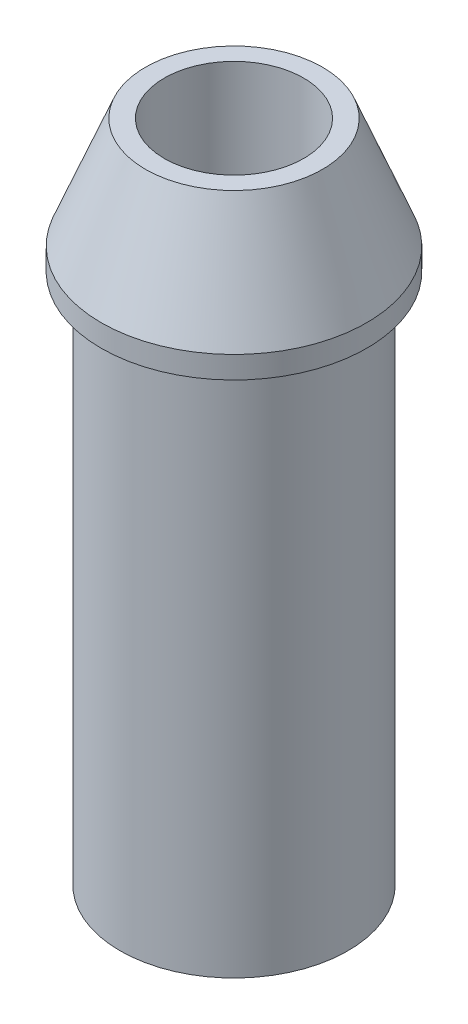
ISO-10303-21;
HEADER;
FILE_DESCRIPTION(('STEP AP214'),'2;1');
FILE_NAME('part.step','',(''),(''),'','','');
FILE_SCHEMA(('AUTOMOTIVE_DESIGN { 1 0 10303 214 1 1 1 1 }'));
ENDSEC;
DATA;
#1=APPLICATION_CONTEXT('core data for automotive mechanical design processes');
#2=APPLICATION_PROTOCOL_DEFINITION('international standard','automotive_design',2000,#1);
#3=PRODUCT_CONTEXT('',#1,'mechanical');
#4=PRODUCT('Part','Part','',(#3));
#5=PRODUCT_RELATED_PRODUCT_CATEGORY('part','',(#4));
#6=PRODUCT_DEFINITION_FORMATION('','',#4);
#7=PRODUCT_DEFINITION_CONTEXT('part definition',#1,'design');
#8=PRODUCT_DEFINITION('design','',#6,#7);
#9=PRODUCT_DEFINITION_SHAPE('','',#8);
#10=(LENGTH_UNIT() NAMED_UNIT(*) SI_UNIT(.MILLI.,.METRE.));
#11=(NAMED_UNIT(*) PLANE_ANGLE_UNIT() SI_UNIT($,.RADIAN.));
#12=(NAMED_UNIT(*) SI_UNIT($,.STERADIAN.) SOLID_ANGLE_UNIT());
#13=UNCERTAINTY_MEASURE_WITH_UNIT(LENGTH_MEASURE(1.E-05),#10,'distance_accuracy_value','');
#14=(GEOMETRIC_REPRESENTATION_CONTEXT(3) GLOBAL_UNCERTAINTY_ASSIGNED_CONTEXT((#13)) GLOBAL_UNIT_ASSIGNED_CONTEXT((#10,
#11,#12)) REPRESENTATION_CONTEXT('',''));
#15=CARTESIAN_POINT('',(0.,0.,0.));
#16=DIRECTION('',(0.,0.,1.));
#17=DIRECTION('',(1.,0.,0.));
#18=AXIS2_PLACEMENT_3D('',#15,#16,#17);
#19=CARTESIAN_POINT('',(0.,15.,0.));
#20=DIRECTION('',(0.,-1.,0.));
#21=DIRECTION('',(0.,0.,-1.));
#22=AXIS2_PLACEMENT_3D('',#19,#20,#21);
#23=CYLINDRICAL_SURFACE('',#22,2.575);
#24=CARTESIAN_POINT('',(0.,0.,0.));
#25=DIRECTION('',(0.,1.,0.));
#26=DIRECTION('',(0.,0.,1.));
#27=AXIS2_PLACEMENT_3D('',#24,#25,#26);
#28=CIRCLE('',#27,2.575);
#29=CARTESIAN_POINT('',(0.,0.,2.575));
#30=VERTEX_POINT('',#29);
#31=EDGE_CURVE('E71',#30,#30,#28,.T.);
#32=ORIENTED_EDGE('',*,*,#31,.T.);
#33=EDGE_LOOP('',(#32));
#34=FACE_BOUND('',#33,.T.);
#35=CARTESIAN_POINT('',(0.,12.,0.));
#36=DIRECTION('',(0.,1.,0.));
#37=DIRECTION('',(0.,0.,1.));
#38=AXIS2_PLACEMENT_3D('',#35,#36,#37);
#39=CIRCLE('',#38,2.575);
#40=CARTESIAN_POINT('',(0.,12.,2.575));
#41=VERTEX_POINT('',#40);
#42=EDGE_CURVE('E64',#41,#41,#39,.T.);
#43=ORIENTED_EDGE('',*,*,#42,.F.);
#44=EDGE_LOOP('',(#43));
#45=FACE_BOUND('',#44,.T.);
#46=ADVANCED_FACE('F48',(#34,#45),#23,.T.);
#47=CARTESIAN_POINT('',(0.,15.,0.));
#48=DIRECTION('',(0.,1.,0.));
#49=DIRECTION('',(0.,0.,1.));
#50=AXIS2_PLACEMENT_3D('',#47,#48,#49);
#51=PLANE('',#50);
#52=CARTESIAN_POINT('',(0.,15.,0.));
#53=DIRECTION('',(0.,1.,0.));
#54=DIRECTION('',(0.,0.,1.));
#55=AXIS2_PLACEMENT_3D('',#52,#53,#54);
#56=CIRCLE('',#55,2.);
#57=CARTESIAN_POINT('',(0.,15.,2.));
#58=VERTEX_POINT('',#57);
#59=EDGE_CURVE('E57',#58,#58,#56,.T.);
#60=ORIENTED_EDGE('',*,*,#59,.T.);
#61=EDGE_LOOP('',(#60));
#62=FACE_BOUND('',#61,.T.);
#63=CARTESIAN_POINT('',(0.,15.,0.));
#64=DIRECTION('',(0.,1.,0.));
#65=DIRECTION('',(0.,0.,1.));
#66=AXIS2_PLACEMENT_3D('',#63,#64,#65);
#67=CIRCLE('',#66,1.575);
#68=CARTESIAN_POINT('',(0.,15.,1.575));
#69=VERTEX_POINT('',#68);
#70=EDGE_CURVE('E77',#69,#69,#67,.T.);
#71=ORIENTED_EDGE('',*,*,#70,.F.);
#72=EDGE_LOOP('',(#71));
#73=FACE_BOUND('',#72,.T.);
#74=ADVANCED_FACE('F102',(#62,#73),#51,.T.);
#75=CARTESIAN_POINT('',(0.,0.,0.));
#76=DIRECTION('',(0.,1.,0.));
#77=DIRECTION('',(0.,0.,1.));
#78=AXIS2_PLACEMENT_3D('',#75,#76,#77);
#79=PLANE('',#78);
#80=ORIENTED_EDGE('',*,*,#31,.F.);
#81=EDGE_LOOP('',(#80));
#82=FACE_BOUND('',#81,.T.);
#83=CARTESIAN_POINT('',(0.,0.,0.));
#84=DIRECTION('',(0.,1.,0.));
#85=DIRECTION('',(0.,0.,1.));
#86=AXIS2_PLACEMENT_3D('',#83,#84,#85);
#87=CIRCLE('',#86,1.575);
#88=CARTESIAN_POINT('',(0.,0.,1.575));
#89=VERTEX_POINT('',#88);
#90=EDGE_CURVE('E78',#89,#89,#87,.T.);
#91=ORIENTED_EDGE('',*,*,#90,.T.);
#92=EDGE_LOOP('',(#91));
#93=FACE_BOUND('',#92,.T.);
#94=ADVANCED_FACE('F107',(#82,#93),#79,.F.);
#95=CARTESIAN_POINT('',(0.,15.,0.));
#96=DIRECTION('',(0.,-1.,0.));
#97=DIRECTION('',(0.,0.,-1.));
#98=AXIS2_PLACEMENT_3D('',#95,#96,#97);
#99=CYLINDRICAL_SURFACE('',#98,1.575);
#100=ORIENTED_EDGE('',*,*,#70,.T.);
#101=EDGE_LOOP('',(#100));
#102=FACE_BOUND('',#101,.T.);
#103=ORIENTED_EDGE('',*,*,#90,.F.);
#104=EDGE_LOOP('',(#103));
#105=FACE_BOUND('',#104,.T.);
#106=ADVANCED_FACE('F97',(#102,#105),#99,.F.);
#107=CARTESIAN_POINT('',(0.,12.,0.));
#108=DIRECTION('',(0.,1.,0.));
#109=DIRECTION('',(0.,0.,1.));
#110=AXIS2_PLACEMENT_3D('',#107,#108,#109);
#111=PLANE('',#110);
#112=CARTESIAN_POINT('',(0.,12.,0.));
#113=DIRECTION('',(0.,1.,0.));
#114=DIRECTION('',(0.,0.,1.));
#115=AXIS2_PLACEMENT_3D('',#112,#113,#114);
#116=CIRCLE('',#115,3.);
#117=CARTESIAN_POINT('',(0.,12.,3.));
#118=VERTEX_POINT('',#117);
#119=EDGE_CURVE('E82',#118,#118,#116,.T.);
#120=ORIENTED_EDGE('',*,*,#119,.F.);
#121=EDGE_LOOP('',(#120));
#122=FACE_BOUND('',#121,.T.);
#123=ORIENTED_EDGE('',*,*,#42,.T.);
#124=EDGE_LOOP('',(#123));
#125=FACE_BOUND('',#124,.T.);
#126=ADVANCED_FACE('F94',(#122,#125),#111,.F.);
#127=CARTESIAN_POINT('',(0.,12.,0.));
#128=DIRECTION('',(0.,1.,0.));
#129=DIRECTION('',(0.,0.,1.));
#130=AXIS2_PLACEMENT_3D('',#127,#128,#129);
#131=CYLINDRICAL_SURFACE('',#130,3.);
#132=CARTESIAN_POINT('',(0.,12.5,0.));
#133=DIRECTION('',(0.,1.,0.));
#134=DIRECTION('',(0.,0.,1.));
#135=AXIS2_PLACEMENT_3D('',#132,#133,#134);
#136=CIRCLE('',#135,3.);
#137=CARTESIAN_POINT('',(0.,12.5,3.));
#138=VERTEX_POINT('',#137);
#139=EDGE_CURVE('E10',#138,#138,#136,.F.);
#140=ORIENTED_EDGE('',*,*,#139,.T.);
#141=EDGE_LOOP('',(#140));
#142=FACE_BOUND('',#141,.T.);
#143=ORIENTED_EDGE('',*,*,#119,.T.);
#144=EDGE_LOOP('',(#143));
#145=FACE_BOUND('',#144,.T.);
#146=ADVANCED_FACE('F92',(#142,#145),#131,.T.);
#147=CARTESIAN_POINT('',(0.,15.,0.));
#148=DIRECTION('',(0.,-1.,0.));
#149=DIRECTION('',(0.,0.,-1.));
#150=AXIS2_PLACEMENT_3D('',#147,#148,#149);
#151=CONICAL_SURFACE('',#150,2.,0.380506377112363);
#152=ORIENTED_EDGE('',*,*,#139,.F.);
#153=EDGE_LOOP('',(#152));
#154=FACE_BOUND('',#153,.T.);
#155=ORIENTED_EDGE('',*,*,#59,.F.);
#156=EDGE_LOOP('',(#155));
#157=FACE_BOUND('',#156,.T.);
#158=ADVANCED_FACE('F51',(#154,#157),#151,.T.);
#159=CLOSED_SHELL('',(#46,#74,#94,#106,#126,#146,#158));
#160=MANIFOLD_SOLID_BREP('B2',#159);
#161=ADVANCED_BREP_SHAPE_REPRESENTATION('',(#18,#160),#14);
#162=SHAPE_DEFINITION_REPRESENTATION(#9,#161);
ENDSEC;
END-ISO-10303-21;
